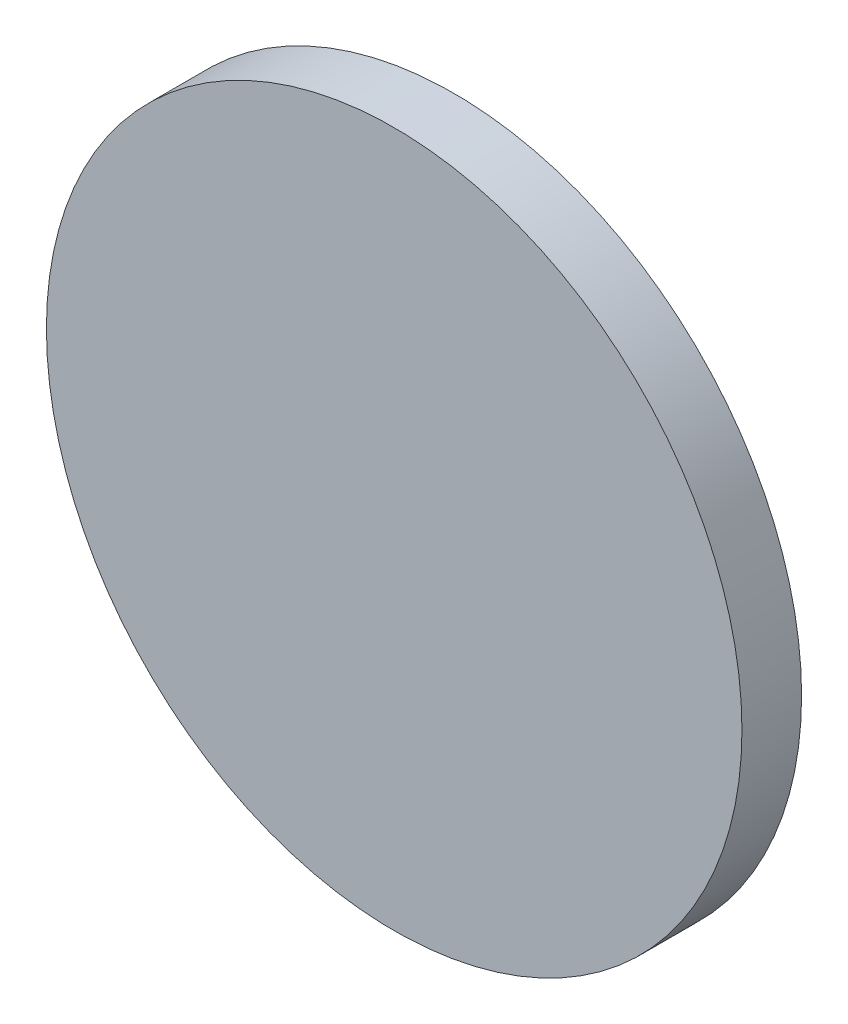
ISO-10303-21;
HEADER;
FILE_DESCRIPTION(('STEP AP214'),'2;1');
FILE_NAME('part.step','',(''),(''),'','','');
FILE_SCHEMA(('AUTOMOTIVE_DESIGN { 1 0 10303 214 1 1 1 1 }'));
ENDSEC;
DATA;
#1=APPLICATION_CONTEXT('core data for automotive mechanical design processes');
#2=APPLICATION_PROTOCOL_DEFINITION('international standard','automotive_design',2000,#1);
#3=PRODUCT_CONTEXT('',#1,'mechanical');
#4=PRODUCT('Part','Part','',(#3));
#5=PRODUCT_RELATED_PRODUCT_CATEGORY('part','',(#4));
#6=PRODUCT_DEFINITION_FORMATION('','',#4);
#7=PRODUCT_DEFINITION_CONTEXT('part definition',#1,'design');
#8=PRODUCT_DEFINITION('design','',#6,#7);
#9=PRODUCT_DEFINITION_SHAPE('','',#8);
#10=(LENGTH_UNIT() NAMED_UNIT(*) SI_UNIT(.MILLI.,.METRE.));
#11=(NAMED_UNIT(*) PLANE_ANGLE_UNIT() SI_UNIT($,.RADIAN.));
#12=(NAMED_UNIT(*) SI_UNIT($,.STERADIAN.) SOLID_ANGLE_UNIT());
#13=UNCERTAINTY_MEASURE_WITH_UNIT(LENGTH_MEASURE(1.E-05),#10,'distance_accuracy_value','');
#14=(GEOMETRIC_REPRESENTATION_CONTEXT(3) GLOBAL_UNCERTAINTY_ASSIGNED_CONTEXT((#13)) GLOBAL_UNIT_ASSIGNED_CONTEXT((#10,
#11,#12)) REPRESENTATION_CONTEXT('',''));
#15=CARTESIAN_POINT('',(0.,0.,0.));
#16=DIRECTION('',(0.,0.,1.));
#17=DIRECTION('',(1.,0.,0.));
#18=AXIS2_PLACEMENT_3D('',#15,#16,#17);
#19=CARTESIAN_POINT('',(2.70764,3.350260006176,0.79916));
#20=DIRECTION('',(0.,0.,1.));
#21=DIRECTION('',(1.,0.,0.));
#22=AXIS2_PLACEMENT_3D('',#19,#20,#21);
#23=PLANE('',#22);
#24=CARTESIAN_POINT('',(2.70764,3.350260006176,0.79916));
#25=DIRECTION('',(0.,0.,1.));
#26=DIRECTION('',(1.,0.,0.));
#27=AXIS2_PLACEMENT_3D('',#24,#25,#26);
#28=CIRCLE('',#27,0.200024667);
#29=CARTESIAN_POINT('',(2.907664667,3.350260006176,0.79916));
#30=VERTEX_POINT('',#29);
#31=EDGE_CURVE('E18',#30,#30,#28,.F.);
#32=ORIENTED_EDGE('',*,*,#31,.F.);
#33=EDGE_LOOP('',(#32));
#34=FACE_BOUND('',#33,.T.);
#35=ADVANCED_FACE('F15',(#34),#23,.T.);
#36=CARTESIAN_POINT('',(2.70764,3.350260006176,0.76487));
#37=DIRECTION('',(0.,0.,1.));
#38=DIRECTION('',(1.,0.,0.));
#39=AXIS2_PLACEMENT_3D('',#36,#37,#38);
#40=CYLINDRICAL_SURFACE('',#39,0.200024667);
#41=ORIENTED_EDGE('',*,*,#31,.T.);
#42=EDGE_LOOP('',(#41));
#43=FACE_BOUND('',#42,.T.);
#44=CARTESIAN_POINT('',(2.70764,3.350260006176,0.76487));
#45=DIRECTION('',(0.,0.,1.));
#46=DIRECTION('',(1.,0.,0.));
#47=AXIS2_PLACEMENT_3D('',#44,#45,#46);
#48=CIRCLE('',#47,0.200024667);
#49=CARTESIAN_POINT('',(2.907664667,3.350260006176,0.76487));
#50=VERTEX_POINT('',#49);
#51=EDGE_CURVE('E10',#50,#50,#48,.F.);
#52=ORIENTED_EDGE('',*,*,#51,.F.);
#53=EDGE_LOOP('',(#52));
#54=FACE_BOUND('',#53,.T.);
#55=ADVANCED_FACE('F27',(#43,#54),#40,.T.);
#56=CARTESIAN_POINT('',(2.70764,3.350260006176,0.76487));
#57=DIRECTION('',(0.,0.,-1.));
#58=DIRECTION('',(-1.,0.,0.));
#59=AXIS2_PLACEMENT_3D('',#56,#57,#58);
#60=PLANE('',#59);
#61=ORIENTED_EDGE('',*,*,#51,.T.);
#62=EDGE_LOOP('',(#61));
#63=FACE_BOUND('',#62,.T.);
#64=ADVANCED_FACE('F35',(#63),#60,.T.);
#65=CLOSED_SHELL('',(#35,#55,#64));
#66=MANIFOLD_SOLID_BREP('B1',#65);
#67=ADVANCED_BREP_SHAPE_REPRESENTATION('',(#18,#66),#14);
#68=SHAPE_DEFINITION_REPRESENTATION(#9,#67);
ENDSEC;
END-ISO-10303-21;
